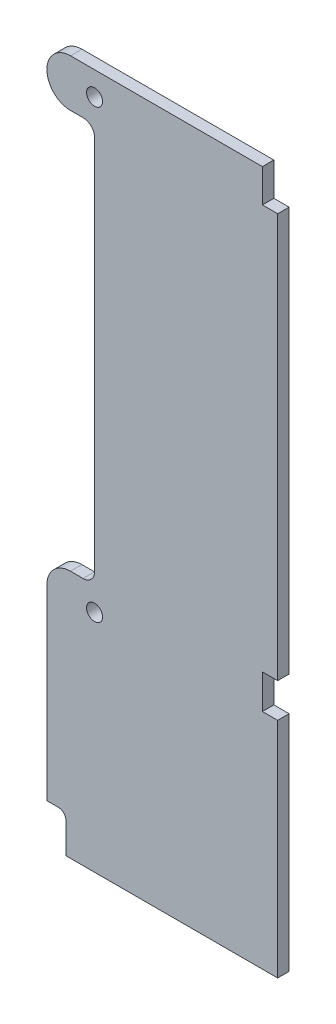
ISO-10303-21;
HEADER;
FILE_DESCRIPTION(('STEP AP214'),'2;1');
FILE_NAME('part.step','',(''),(''),'','','');
FILE_SCHEMA(('AUTOMOTIVE_DESIGN { 1 0 10303 214 1 1 1 1 }'));
ENDSEC;
DATA;
#1=APPLICATION_CONTEXT('core data for automotive mechanical design processes');
#2=APPLICATION_PROTOCOL_DEFINITION('international standard','automotive_design',2000,#1);
#3=PRODUCT_CONTEXT('',#1,'mechanical');
#4=PRODUCT('Part','Part','',(#3));
#5=PRODUCT_RELATED_PRODUCT_CATEGORY('part','',(#4));
#6=PRODUCT_DEFINITION_FORMATION('','',#4);
#7=PRODUCT_DEFINITION_CONTEXT('part definition',#1,'design');
#8=PRODUCT_DEFINITION('design','',#6,#7);
#9=PRODUCT_DEFINITION_SHAPE('','',#8);
#10=(LENGTH_UNIT() NAMED_UNIT(*) SI_UNIT(.MILLI.,.METRE.));
#11=(NAMED_UNIT(*) PLANE_ANGLE_UNIT() SI_UNIT($,.RADIAN.));
#12=(NAMED_UNIT(*) SI_UNIT($,.STERADIAN.) SOLID_ANGLE_UNIT());
#13=UNCERTAINTY_MEASURE_WITH_UNIT(LENGTH_MEASURE(1.E-05),#10,'distance_accuracy_value','');
#14=(GEOMETRIC_REPRESENTATION_CONTEXT(3) GLOBAL_UNCERTAINTY_ASSIGNED_CONTEXT((#13)) GLOBAL_UNIT_ASSIGNED_CONTEXT((#10,
#11,#12)) REPRESENTATION_CONTEXT('',''));
#15=CARTESIAN_POINT('',(0.,0.,0.));
#16=DIRECTION('',(0.,0.,1.));
#17=DIRECTION('',(1.,0.,0.));
#18=AXIS2_PLACEMENT_3D('',#15,#16,#17);
#19=CARTESIAN_POINT('',(-6.3,0.,3.));
#20=DIRECTION('',(0.,0.,1.));
#21=DIRECTION('',(1.,0.,0.));
#22=AXIS2_PLACEMENT_3D('',#19,#20,#21);
#23=PLANE('',#22);
#24=CARTESIAN_POINT('',(0.,0.,3.));
#25=DIRECTION('',(0.,0.,1.));
#26=DIRECTION('',(1.,0.,0.));
#27=AXIS2_PLACEMENT_3D('',#24,#25,#26);
#28=CIRCLE('',#27,2.1);
#29=CARTESIAN_POINT('',(2.1,0.,3.));
#30=VERTEX_POINT('',#29);
#31=EDGE_CURVE('E212',#30,#30,#28,.T.);
#32=ORIENTED_EDGE('',*,*,#31,.F.);
#33=EDGE_LOOP('',(#32));
#34=FACE_BOUND('',#33,.T.);
#35=CARTESIAN_POINT('',(-6.3,0.,3.));
#36=DIRECTION('',(0.,0.,1.));
#37=DIRECTION('',(1.,0.,0.));
#38=AXIS2_PLACEMENT_3D('',#35,#36,#37);
#39=CIRCLE('',#38,6.2);
#40=CARTESIAN_POINT('',(-6.3,6.2,3.));
#41=VERTEX_POINT('',#40);
#42=CARTESIAN_POINT('',(-12.5,0.,3.));
#43=VERTEX_POINT('',#42);
#44=EDGE_CURVE('E248',#41,#43,#39,.T.);
#45=ORIENTED_EDGE('',*,*,#44,.T.);
#46=DIRECTION('',(0.,-1.,0.));
#47=VECTOR('',#46,1.);
#48=CARTESIAN_POINT('',(-12.5,0.,3.));
#49=LINE('',#48,#47);
#50=CARTESIAN_POINT('',(-12.5,-49.,3.));
#51=VERTEX_POINT('',#50);
#52=EDGE_CURVE('E135',#43,#51,#49,.T.);
#53=ORIENTED_EDGE('',*,*,#52,.T.);
#54=DIRECTION('',(1.,0.,0.));
#55=VECTOR('',#54,1.);
#56=CARTESIAN_POINT('',(-12.5,-49.,3.));
#57=LINE('',#56,#55);
#58=CARTESIAN_POINT('',(-9.50000000000001,-49.,3.));
#59=VERTEX_POINT('',#58);
#60=EDGE_CURVE('E299',#51,#59,#57,.T.);
#61=ORIENTED_EDGE('',*,*,#60,.T.);
#62=CARTESIAN_POINT('',(-9.49999999999999,-51.,3.));
#63=DIRECTION('',(0.,0.,-1.));
#64=DIRECTION('',(1.,0.,0.));
#65=AXIS2_PLACEMENT_3D('',#62,#63,#64);
#66=CIRCLE('',#65,2.);
#67=CARTESIAN_POINT('',(-7.49999999999999,-51.,3.));
#68=VERTEX_POINT('',#67);
#69=EDGE_CURVE('E318',#59,#68,#66,.T.);
#70=ORIENTED_EDGE('',*,*,#69,.T.);
#71=DIRECTION('',(0.,-1.,0.));
#72=VECTOR('',#71,1.);
#73=CARTESIAN_POINT('',(-7.49999999999999,-51.,3.));
#74=LINE('',#73,#72);
#75=CARTESIAN_POINT('',(-7.49999999999999,-59.,3.));
#76=VERTEX_POINT('',#75);
#77=EDGE_CURVE('E315',#68,#76,#74,.T.);
#78=ORIENTED_EDGE('',*,*,#77,.T.);
#79=DIRECTION('',(1.,0.,0.));
#80=VECTOR('',#79,1.);
#81=CARTESIAN_POINT('',(-7.49999999999999,-59.,3.));
#82=LINE('',#81,#80);
#83=CARTESIAN_POINT('',(48.,-59.,3.));
#84=VERTEX_POINT('',#83);
#85=EDGE_CURVE('E317',#76,#84,#82,.T.);
#86=ORIENTED_EDGE('',*,*,#85,.T.);
#87=DIRECTION('',(0.,1.,0.));
#88=VECTOR('',#87,1.);
#89=CARTESIAN_POINT('',(48.,-0.5,3.));
#90=LINE('',#89,#88);
#91=CARTESIAN_POINT('',(48.,-0.5,3.));
#92=VERTEX_POINT('',#91);
#93=EDGE_CURVE('E320',#84,#92,#90,.T.);
#94=ORIENTED_EDGE('',*,*,#93,.T.);
#95=DIRECTION('',(-1.,0.,0.));
#96=VECTOR('',#95,1.);
#97=CARTESIAN_POINT('',(48.,-0.5,3.));
#98=LINE('',#97,#96);
#99=CARTESIAN_POINT('',(44.,-0.5,3.));
#100=VERTEX_POINT('',#99);
#101=EDGE_CURVE('E326',#92,#100,#98,.T.);
#102=ORIENTED_EDGE('',*,*,#101,.T.);
#103=DIRECTION('',(0.,1.,0.));
#104=VECTOR('',#103,1.);
#105=CARTESIAN_POINT('',(44.,-0.5,3.));
#106=LINE('',#105,#104);
#107=CARTESIAN_POINT('',(44.,8.5,3.));
#108=VERTEX_POINT('',#107);
#109=EDGE_CURVE('E328',#100,#108,#106,.T.);
#110=ORIENTED_EDGE('',*,*,#109,.T.);
#111=DIRECTION('',(1.,0.,0.));
#112=VECTOR('',#111,1.);
#113=CARTESIAN_POINT('',(44.,8.5,3.));
#114=LINE('',#113,#112);
#115=CARTESIAN_POINT('',(48.,8.5,3.));
#116=VERTEX_POINT('',#115);
#117=EDGE_CURVE('E330',#108,#116,#114,.T.);
#118=ORIENTED_EDGE('',*,*,#117,.T.);
#119=DIRECTION('',(0.,1.,0.));
#120=VECTOR('',#119,1.);
#121=CARTESIAN_POINT('',(48.,114.5,3.));
#122=LINE('',#121,#120);
#123=CARTESIAN_POINT('',(48.,114.5,3.));
#124=VERTEX_POINT('',#123);
#125=EDGE_CURVE('E332',#116,#124,#122,.T.);
#126=ORIENTED_EDGE('',*,*,#125,.T.);
#127=DIRECTION('',(-1.,0.,0.));
#128=VECTOR('',#127,1.);
#129=CARTESIAN_POINT('',(48.,114.5,3.));
#130=LINE('',#129,#128);
#131=CARTESIAN_POINT('',(44.,114.5,3.));
#132=VERTEX_POINT('',#131);
#133=EDGE_CURVE('E334',#124,#132,#130,.T.);
#134=ORIENTED_EDGE('',*,*,#133,.T.);
#135=DIRECTION('',(0.,1.,0.));
#136=VECTOR('',#135,1.);
#137=CARTESIAN_POINT('',(44.,114.5,3.));
#138=LINE('',#137,#136);
#139=CARTESIAN_POINT('',(44.,123.2,3.));
#140=VERTEX_POINT('',#139);
#141=EDGE_CURVE('E336',#132,#140,#138,.T.);
#142=ORIENTED_EDGE('',*,*,#141,.T.);
#143=DIRECTION('',(-1.,0.,0.));
#144=VECTOR('',#143,1.);
#145=CARTESIAN_POINT('',(-6.30000000000002,123.2,3.));
#146=LINE('',#145,#144);
#147=CARTESIAN_POINT('',(-6.30000000000002,123.2,3.));
#148=VERTEX_POINT('',#147);
#149=EDGE_CURVE('E338',#140,#148,#146,.T.);
#150=ORIENTED_EDGE('',*,*,#149,.T.);
#151=CARTESIAN_POINT('',(-6.30000000000002,117.,3.));
#152=DIRECTION('',(0.,0.,1.));
#153=DIRECTION('',(1.,0.,0.));
#154=AXIS2_PLACEMENT_3D('',#151,#152,#153);
#155=CIRCLE('',#154,6.2);
#156=CARTESIAN_POINT('',(-6.30000000000002,110.8,3.));
#157=VERTEX_POINT('',#156);
#158=EDGE_CURVE('E340',#148,#157,#155,.T.);
#159=ORIENTED_EDGE('',*,*,#158,.T.);
#160=DIRECTION('',(1.,0.,0.));
#161=VECTOR('',#160,1.);
#162=CARTESIAN_POINT('',(-6.30000000000002,110.8,3.));
#163=LINE('',#162,#161);
#164=CARTESIAN_POINT('',(-3.00000000000004,110.8,3.));
#165=VERTEX_POINT('',#164);
#166=EDGE_CURVE('E342',#157,#165,#163,.T.);
#167=ORIENTED_EDGE('',*,*,#166,.T.);
#168=CARTESIAN_POINT('',(-3.00000000000001,107.8,3.));
#169=DIRECTION('',(0.,0.,-1.));
#170=DIRECTION('',(1.,0.,0.));
#171=AXIS2_PLACEMENT_3D('',#168,#169,#170);
#172=CIRCLE('',#171,3.);
#173=CARTESIAN_POINT('',(0.,107.8,3.));
#174=VERTEX_POINT('',#173);
#175=EDGE_CURVE('E190',#165,#174,#172,.T.);
#176=ORIENTED_EDGE('',*,*,#175,.T.);
#177=DIRECTION('',(0.,-1.,0.));
#178=VECTOR('',#177,1.);
#179=CARTESIAN_POINT('',(0.,107.8,3.));
#180=LINE('',#179,#178);
#181=CARTESIAN_POINT('',(0.,9.20000000000002,3.));
#182=VERTEX_POINT('',#181);
#183=EDGE_CURVE('E184',#174,#182,#180,.T.);
#184=ORIENTED_EDGE('',*,*,#183,.T.);
#185=CARTESIAN_POINT('',(-3.,9.2,3.));
#186=DIRECTION('',(0.,0.,-1.));
#187=DIRECTION('',(-1.,0.,0.));
#188=AXIS2_PLACEMENT_3D('',#185,#186,#187);
#189=CIRCLE('',#188,3.);
#190=CARTESIAN_POINT('',(-3.00000000000002,6.2,3.));
#191=VERTEX_POINT('',#190);
#192=EDGE_CURVE('E188',#182,#191,#189,.T.);
#193=ORIENTED_EDGE('',*,*,#192,.T.);
#194=DIRECTION('',(-1.,0.,0.));
#195=VECTOR('',#194,1.);
#196=CARTESIAN_POINT('',(-3.00000000000002,6.2,3.));
#197=LINE('',#196,#195);
#198=EDGE_CURVE('E56',#191,#41,#197,.T.);
#199=ORIENTED_EDGE('',*,*,#198,.T.);
#200=EDGE_LOOP('',(#45,#53,#61,#70,#78,#86,#94,#102,#110,#118,#126,#134,#142,#150,#159,#167,
#176,#184,#193,#199));
#201=FACE_BOUND('',#200,.T.);
#202=CARTESIAN_POINT('',(0.,117.,3.));
#203=DIRECTION('',(0.,0.,1.));
#204=DIRECTION('',(1.,0.,0.));
#205=AXIS2_PLACEMENT_3D('',#202,#203,#204);
#206=CIRCLE('',#205,2.1);
#207=CARTESIAN_POINT('',(2.1,117.,3.));
#208=VERTEX_POINT('',#207);
#209=EDGE_CURVE('E385',#208,#208,#206,.T.);
#210=ORIENTED_EDGE('',*,*,#209,.F.);
#211=EDGE_LOOP('',(#210));
#212=FACE_BOUND('',#211,.T.);
#213=ADVANCED_FACE('F39',(#34,#201,#212),#23,.T.);
#214=CARTESIAN_POINT('',(-6.3,0.,0.));
#215=DIRECTION('',(0.,0.,1.));
#216=DIRECTION('',(1.,0.,0.));
#217=AXIS2_PLACEMENT_3D('',#214,#215,#216);
#218=PLANE('',#217);
#219=CARTESIAN_POINT('',(0.,0.,0.));
#220=DIRECTION('',(0.,0.,1.));
#221=DIRECTION('',(1.,0.,0.));
#222=AXIS2_PLACEMENT_3D('',#219,#220,#221);
#223=CIRCLE('',#222,2.1);
#224=CARTESIAN_POINT('',(2.1,0.,0.));
#225=VERTEX_POINT('',#224);
#226=EDGE_CURVE('E390',#225,#225,#223,.T.);
#227=ORIENTED_EDGE('',*,*,#226,.T.);
#228=EDGE_LOOP('',(#227));
#229=FACE_BOUND('',#228,.T.);
#230=CARTESIAN_POINT('',(-6.3,0.,0.));
#231=DIRECTION('',(0.,0.,1.));
#232=DIRECTION('',(1.,0.,0.));
#233=AXIS2_PLACEMENT_3D('',#230,#231,#232);
#234=CIRCLE('',#233,6.2);
#235=CARTESIAN_POINT('',(-6.3,6.2,0.));
#236=VERTEX_POINT('',#235);
#237=CARTESIAN_POINT('',(-12.5,0.,0.));
#238=VERTEX_POINT('',#237);
#239=EDGE_CURVE('E208',#236,#238,#234,.T.);
#240=ORIENTED_EDGE('',*,*,#239,.F.);
#241=DIRECTION('',(-1.,0.,0.));
#242=VECTOR('',#241,1.);
#243=CARTESIAN_POINT('',(-3.00000000000002,6.2,0.));
#244=LINE('',#243,#242);
#245=CARTESIAN_POINT('',(-3.00000000000002,6.2,0.));
#246=VERTEX_POINT('',#245);
#247=EDGE_CURVE('E127',#246,#236,#244,.T.);
#248=ORIENTED_EDGE('',*,*,#247,.F.);
#249=CARTESIAN_POINT('',(-3.,9.2,0.));
#250=DIRECTION('',(0.,0.,-1.));
#251=DIRECTION('',(-1.,0.,0.));
#252=AXIS2_PLACEMENT_3D('',#249,#250,#251);
#253=CIRCLE('',#252,3.);
#254=CARTESIAN_POINT('',(0.,9.20000000000002,0.));
#255=VERTEX_POINT('',#254);
#256=EDGE_CURVE('E121',#255,#246,#253,.T.);
#257=ORIENTED_EDGE('',*,*,#256,.F.);
#258=DIRECTION('',(0.,-1.,0.));
#259=VECTOR('',#258,1.);
#260=CARTESIAN_POINT('',(0.,107.8,0.));
#261=LINE('',#260,#259);
#262=CARTESIAN_POINT('',(0.,107.8,0.));
#263=VERTEX_POINT('',#262);
#264=EDGE_CURVE('E198',#263,#255,#261,.T.);
#265=ORIENTED_EDGE('',*,*,#264,.F.);
#266=CARTESIAN_POINT('',(-3.00000000000001,107.8,0.));
#267=DIRECTION('',(0.,0.,-1.));
#268=DIRECTION('',(1.,0.,0.));
#269=AXIS2_PLACEMENT_3D('',#266,#267,#268);
#270=CIRCLE('',#269,3.);
#271=CARTESIAN_POINT('',(-3.00000000000004,110.8,0.));
#272=VERTEX_POINT('',#271);
#273=EDGE_CURVE('E243',#272,#263,#270,.T.);
#274=ORIENTED_EDGE('',*,*,#273,.F.);
#275=DIRECTION('',(1.,0.,0.));
#276=VECTOR('',#275,1.);
#277=CARTESIAN_POINT('',(-6.30000000000002,110.8,0.));
#278=LINE('',#277,#276);
#279=CARTESIAN_POINT('',(-6.30000000000002,110.8,0.));
#280=VERTEX_POINT('',#279);
#281=EDGE_CURVE('E241',#280,#272,#278,.T.);
#282=ORIENTED_EDGE('',*,*,#281,.F.);
#283=CARTESIAN_POINT('',(-6.30000000000002,117.,0.));
#284=DIRECTION('',(0.,0.,1.));
#285=DIRECTION('',(1.,0.,0.));
#286=AXIS2_PLACEMENT_3D('',#283,#284,#285);
#287=CIRCLE('',#286,6.2);
#288=CARTESIAN_POINT('',(-6.30000000000002,123.2,0.));
#289=VERTEX_POINT('',#288);
#290=EDGE_CURVE('E239',#289,#280,#287,.T.);
#291=ORIENTED_EDGE('',*,*,#290,.F.);
#292=DIRECTION('',(-1.,0.,0.));
#293=VECTOR('',#292,1.);
#294=CARTESIAN_POINT('',(-6.30000000000002,123.2,0.));
#295=LINE('',#294,#293);
#296=CARTESIAN_POINT('',(44.,123.2,0.));
#297=VERTEX_POINT('',#296);
#298=EDGE_CURVE('E237',#297,#289,#295,.T.);
#299=ORIENTED_EDGE('',*,*,#298,.F.);
#300=DIRECTION('',(0.,1.,0.));
#301=VECTOR('',#300,1.);
#302=CARTESIAN_POINT('',(44.,114.5,0.));
#303=LINE('',#302,#301);
#304=CARTESIAN_POINT('',(44.,114.5,0.));
#305=VERTEX_POINT('',#304);
#306=EDGE_CURVE('E235',#305,#297,#303,.T.);
#307=ORIENTED_EDGE('',*,*,#306,.F.);
#308=DIRECTION('',(-1.,0.,0.));
#309=VECTOR('',#308,1.);
#310=CARTESIAN_POINT('',(48.,114.5,0.));
#311=LINE('',#310,#309);
#312=CARTESIAN_POINT('',(48.,114.5,0.));
#313=VERTEX_POINT('',#312);
#314=EDGE_CURVE('E233',#313,#305,#311,.T.);
#315=ORIENTED_EDGE('',*,*,#314,.F.);
#316=DIRECTION('',(0.,1.,0.));
#317=VECTOR('',#316,1.);
#318=CARTESIAN_POINT('',(48.,114.5,0.));
#319=LINE('',#318,#317);
#320=CARTESIAN_POINT('',(48.,8.5,0.));
#321=VERTEX_POINT('',#320);
#322=EDGE_CURVE('E231',#321,#313,#319,.T.);
#323=ORIENTED_EDGE('',*,*,#322,.F.);
#324=DIRECTION('',(1.,0.,0.));
#325=VECTOR('',#324,1.);
#326=CARTESIAN_POINT('',(44.,8.5,0.));
#327=LINE('',#326,#325);
#328=CARTESIAN_POINT('',(44.,8.5,0.));
#329=VERTEX_POINT('',#328);
#330=EDGE_CURVE('E229',#329,#321,#327,.T.);
#331=ORIENTED_EDGE('',*,*,#330,.F.);
#332=DIRECTION('',(0.,1.,0.));
#333=VECTOR('',#332,1.);
#334=CARTESIAN_POINT('',(44.,-0.5,0.));
#335=LINE('',#334,#333);
#336=CARTESIAN_POINT('',(44.,-0.5,0.));
#337=VERTEX_POINT('',#336);
#338=EDGE_CURVE('E227',#337,#329,#335,.T.);
#339=ORIENTED_EDGE('',*,*,#338,.F.);
#340=DIRECTION('',(-1.,0.,0.));
#341=VECTOR('',#340,1.);
#342=CARTESIAN_POINT('',(48.,-0.5,0.));
#343=LINE('',#342,#341);
#344=CARTESIAN_POINT('',(48.,-0.5,0.));
#345=VERTEX_POINT('',#344);
#346=EDGE_CURVE('E225',#345,#337,#343,.T.);
#347=ORIENTED_EDGE('',*,*,#346,.F.);
#348=DIRECTION('',(0.,1.,0.));
#349=VECTOR('',#348,1.);
#350=CARTESIAN_POINT('',(48.,-0.5,0.));
#351=LINE('',#350,#349);
#352=CARTESIAN_POINT('',(48.,-59.,0.));
#353=VERTEX_POINT('',#352);
#354=EDGE_CURVE('E223',#353,#345,#351,.T.);
#355=ORIENTED_EDGE('',*,*,#354,.F.);
#356=DIRECTION('',(1.,0.,0.));
#357=VECTOR('',#356,1.);
#358=CARTESIAN_POINT('',(-7.49999999999999,-59.,0.));
#359=LINE('',#358,#357);
#360=CARTESIAN_POINT('',(-7.49999999999999,-59.,0.));
#361=VERTEX_POINT('',#360);
#362=EDGE_CURVE('E221',#361,#353,#359,.T.);
#363=ORIENTED_EDGE('',*,*,#362,.F.);
#364=DIRECTION('',(0.,-1.,0.));
#365=VECTOR('',#364,1.);
#366=CARTESIAN_POINT('',(-7.49999999999999,-51.,0.));
#367=LINE('',#366,#365);
#368=CARTESIAN_POINT('',(-7.49999999999999,-51.,0.));
#369=VERTEX_POINT('',#368);
#370=EDGE_CURVE('E219',#369,#361,#367,.T.);
#371=ORIENTED_EDGE('',*,*,#370,.F.);
#372=CARTESIAN_POINT('',(-9.49999999999999,-51.,0.));
#373=DIRECTION('',(0.,0.,-1.));
#374=DIRECTION('',(1.,0.,0.));
#375=AXIS2_PLACEMENT_3D('',#372,#373,#374);
#376=CIRCLE('',#375,2.);
#377=CARTESIAN_POINT('',(-9.50000000000001,-49.,0.));
#378=VERTEX_POINT('',#377);
#379=EDGE_CURVE('E217',#378,#369,#376,.T.);
#380=ORIENTED_EDGE('',*,*,#379,.F.);
#381=DIRECTION('',(1.,0.,0.));
#382=VECTOR('',#381,1.);
#383=CARTESIAN_POINT('',(-12.5,-49.,0.));
#384=LINE('',#383,#382);
#385=CARTESIAN_POINT('',(-12.5,-49.,0.));
#386=VERTEX_POINT('',#385);
#387=EDGE_CURVE('E215',#386,#378,#384,.T.);
#388=ORIENTED_EDGE('',*,*,#387,.F.);
#389=DIRECTION('',(0.,-1.,0.));
#390=VECTOR('',#389,1.);
#391=CARTESIAN_POINT('',(-12.5,0.,0.));
#392=LINE('',#391,#390);
#393=EDGE_CURVE('E211',#238,#386,#392,.T.);
#394=ORIENTED_EDGE('',*,*,#393,.F.);
#395=EDGE_LOOP('',(#240,#248,#257,#265,#274,#282,#291,#299,#307,#315,#323,#331,#339,#347,#355,
#363,#371,#380,#388,#394));
#396=FACE_BOUND('',#395,.T.);
#397=CARTESIAN_POINT('',(0.,117.,0.));
#398=DIRECTION('',(0.,0.,1.));
#399=DIRECTION('',(1.,0.,0.));
#400=AXIS2_PLACEMENT_3D('',#397,#398,#399);
#401=CIRCLE('',#400,2.1);
#402=CARTESIAN_POINT('',(2.1,117.,0.));
#403=VERTEX_POINT('',#402);
#404=EDGE_CURVE('E388',#403,#403,#401,.T.);
#405=ORIENTED_EDGE('',*,*,#404,.T.);
#406=EDGE_LOOP('',(#405));
#407=FACE_BOUND('',#406,.T.);
#408=ADVANCED_FACE('F303',(#229,#396,#407),#218,.F.);
#409=CARTESIAN_POINT('',(-6.3,0.,3.));
#410=DIRECTION('',(0.,0.,-1.));
#411=DIRECTION('',(-1.,0.,0.));
#412=AXIS2_PLACEMENT_3D('',#409,#410,#411);
#413=CYLINDRICAL_SURFACE('',#412,6.2);
#414=ORIENTED_EDGE('',*,*,#239,.T.);
#415=DIRECTION('',(0.,0.,-1.));
#416=VECTOR('',#415,1.);
#417=CARTESIAN_POINT('',(-12.5,0.,3.));
#418=LINE('',#417,#416);
#419=EDGE_CURVE('E11',#43,#238,#418,.T.);
#420=ORIENTED_EDGE('',*,*,#419,.F.);
#421=ORIENTED_EDGE('',*,*,#44,.F.);
#422=DIRECTION('',(0.,0.,-1.));
#423=VECTOR('',#422,1.);
#424=CARTESIAN_POINT('',(-6.3,6.2,3.));
#425=LINE('',#424,#423);
#426=EDGE_CURVE('E204',#41,#236,#425,.T.);
#427=ORIENTED_EDGE('',*,*,#426,.T.);
#428=EDGE_LOOP('',(#414,#420,#421,#427));
#429=FACE_BOUND('',#428,.T.);
#430=ADVANCED_FACE('F41',(#429),#413,.T.);
#431=CARTESIAN_POINT('',(-12.5,0.,3.));
#432=DIRECTION('',(1.,0.,0.));
#433=DIRECTION('',(0.,1.,0.));
#434=AXIS2_PLACEMENT_3D('',#431,#432,#433);
#435=PLANE('',#434);
#436=ORIENTED_EDGE('',*,*,#393,.T.);
#437=DIRECTION('',(0.,0.,-1.));
#438=VECTOR('',#437,1.);
#439=CARTESIAN_POINT('',(-12.5,-49.,3.));
#440=LINE('',#439,#438);
#441=EDGE_CURVE('E48',#51,#386,#440,.T.);
#442=ORIENTED_EDGE('',*,*,#441,.F.);
#443=ORIENTED_EDGE('',*,*,#52,.F.);
#444=ORIENTED_EDGE('',*,*,#419,.T.);
#445=EDGE_LOOP('',(#436,#442,#443,#444));
#446=FACE_BOUND('',#445,.T.);
#447=ADVANCED_FACE('F564',(#446),#435,.F.);
#448=CARTESIAN_POINT('',(-12.5,-49.,3.));
#449=DIRECTION('',(0.,1.,0.));
#450=DIRECTION('',(0.,0.,1.));
#451=AXIS2_PLACEMENT_3D('',#448,#449,#450);
#452=PLANE('',#451);
#453=ORIENTED_EDGE('',*,*,#387,.T.);
#454=DIRECTION('',(0.,0.,-1.));
#455=VECTOR('',#454,1.);
#456=CARTESIAN_POINT('',(-9.50000000000001,-49.,3.));
#457=LINE('',#456,#455);
#458=EDGE_CURVE('E291',#59,#378,#457,.T.);
#459=ORIENTED_EDGE('',*,*,#458,.F.);
#460=ORIENTED_EDGE('',*,*,#60,.F.);
#461=ORIENTED_EDGE('',*,*,#441,.T.);
#462=EDGE_LOOP('',(#453,#459,#460,#461));
#463=FACE_BOUND('',#462,.T.);
#464=ADVANCED_FACE('F297',(#463),#452,.F.);
#465=CARTESIAN_POINT('',(-9.49999999999999,-51.,3.));
#466=DIRECTION('',(0.,0.,-1.));
#467=DIRECTION('',(-1.,0.,0.));
#468=AXIS2_PLACEMENT_3D('',#465,#466,#467);
#469=CYLINDRICAL_SURFACE('',#468,2.);
#470=ORIENTED_EDGE('',*,*,#379,.T.);
#471=DIRECTION('',(0.,0.,-1.));
#472=VECTOR('',#471,1.);
#473=CARTESIAN_POINT('',(-7.49999999999999,-51.,3.));
#474=LINE('',#473,#472);
#475=EDGE_CURVE('E288',#68,#369,#474,.T.);
#476=ORIENTED_EDGE('',*,*,#475,.F.);
#477=ORIENTED_EDGE('',*,*,#69,.F.);
#478=ORIENTED_EDGE('',*,*,#458,.T.);
#479=EDGE_LOOP('',(#470,#476,#477,#478));
#480=FACE_BOUND('',#479,.T.);
#481=ADVANCED_FACE('F309',(#480),#469,.F.);
#482=CARTESIAN_POINT('',(-7.49999999999999,-51.,3.));
#483=DIRECTION('',(1.,0.,0.));
#484=DIRECTION('',(0.,1.,0.));
#485=AXIS2_PLACEMENT_3D('',#482,#483,#484);
#486=PLANE('',#485);
#487=ORIENTED_EDGE('',*,*,#370,.T.);
#488=DIRECTION('',(0.,0.,-1.));
#489=VECTOR('',#488,1.);
#490=CARTESIAN_POINT('',(-7.49999999999999,-59.,3.));
#491=LINE('',#490,#489);
#492=EDGE_CURVE('E285',#76,#361,#491,.T.);
#493=ORIENTED_EDGE('',*,*,#492,.F.);
#494=ORIENTED_EDGE('',*,*,#77,.F.);
#495=ORIENTED_EDGE('',*,*,#475,.T.);
#496=EDGE_LOOP('',(#487,#493,#494,#495));
#497=FACE_BOUND('',#496,.T.);
#498=ADVANCED_FACE('F313',(#497),#486,.F.);
#499=CARTESIAN_POINT('',(-7.49999999999999,-59.,3.));
#500=DIRECTION('',(0.,1.,0.));
#501=DIRECTION('',(0.,0.,1.));
#502=AXIS2_PLACEMENT_3D('',#499,#500,#501);
#503=PLANE('',#502);
#504=ORIENTED_EDGE('',*,*,#362,.T.);
#505=DIRECTION('',(0.,0.,-1.));
#506=VECTOR('',#505,1.);
#507=CARTESIAN_POINT('',(48.,-59.,3.));
#508=LINE('',#507,#506);
#509=EDGE_CURVE('E282',#84,#353,#508,.T.);
#510=ORIENTED_EDGE('',*,*,#509,.F.);
#511=ORIENTED_EDGE('',*,*,#85,.F.);
#512=ORIENTED_EDGE('',*,*,#492,.T.);
#513=EDGE_LOOP('',(#504,#510,#511,#512));
#514=FACE_BOUND('',#513,.T.);
#515=ADVANCED_FACE('F529',(#514),#503,.F.);
#516=CARTESIAN_POINT('',(48.,-0.5,3.));
#517=DIRECTION('',(-1.,0.,0.));
#518=DIRECTION('',(0.,-1.,0.));
#519=AXIS2_PLACEMENT_3D('',#516,#517,#518);
#520=PLANE('',#519);
#521=ORIENTED_EDGE('',*,*,#354,.T.);
#522=DIRECTION('',(0.,0.,-1.));
#523=VECTOR('',#522,1.);
#524=CARTESIAN_POINT('',(48.,-0.5,3.));
#525=LINE('',#524,#523);
#526=EDGE_CURVE('E279',#92,#345,#525,.T.);
#527=ORIENTED_EDGE('',*,*,#526,.F.);
#528=ORIENTED_EDGE('',*,*,#93,.F.);
#529=ORIENTED_EDGE('',*,*,#509,.T.);
#530=EDGE_LOOP('',(#521,#527,#528,#529));
#531=FACE_BOUND('',#530,.T.);
#532=ADVANCED_FACE('F519',(#531),#520,.F.);
#533=CARTESIAN_POINT('',(48.,-0.5,3.));
#534=DIRECTION('',(0.,-1.,0.));
#535=DIRECTION('',(0.,0.,-1.));
#536=AXIS2_PLACEMENT_3D('',#533,#534,#535);
#537=PLANE('',#536);
#538=ORIENTED_EDGE('',*,*,#346,.T.);
#539=DIRECTION('',(0.,0.,-1.));
#540=VECTOR('',#539,1.);
#541=CARTESIAN_POINT('',(44.,-0.5,3.));
#542=LINE('',#541,#540);
#543=EDGE_CURVE('E276',#100,#337,#542,.T.);
#544=ORIENTED_EDGE('',*,*,#543,.F.);
#545=ORIENTED_EDGE('',*,*,#101,.F.);
#546=ORIENTED_EDGE('',*,*,#526,.T.);
#547=EDGE_LOOP('',(#538,#544,#545,#546));
#548=FACE_BOUND('',#547,.T.);
#549=ADVANCED_FACE('F509',(#548),#537,.F.);
#550=CARTESIAN_POINT('',(44.,-0.5,3.));
#551=DIRECTION('',(-1.,0.,0.));
#552=DIRECTION('',(0.,-1.,0.));
#553=AXIS2_PLACEMENT_3D('',#550,#551,#552);
#554=PLANE('',#553);
#555=ORIENTED_EDGE('',*,*,#338,.T.);
#556=DIRECTION('',(0.,0.,-1.));
#557=VECTOR('',#556,1.);
#558=CARTESIAN_POINT('',(44.,8.5,3.));
#559=LINE('',#558,#557);
#560=EDGE_CURVE('E273',#108,#329,#559,.T.);
#561=ORIENTED_EDGE('',*,*,#560,.F.);
#562=ORIENTED_EDGE('',*,*,#109,.F.);
#563=ORIENTED_EDGE('',*,*,#543,.T.);
#564=EDGE_LOOP('',(#555,#561,#562,#563));
#565=FACE_BOUND('',#564,.T.);
#566=ADVANCED_FACE('F499',(#565),#554,.F.);
#567=CARTESIAN_POINT('',(44.,8.5,3.));
#568=DIRECTION('',(0.,1.,0.));
#569=DIRECTION('',(0.,0.,1.));
#570=AXIS2_PLACEMENT_3D('',#567,#568,#569);
#571=PLANE('',#570);
#572=ORIENTED_EDGE('',*,*,#330,.T.);
#573=DIRECTION('',(0.,0.,-1.));
#574=VECTOR('',#573,1.);
#575=CARTESIAN_POINT('',(48.,8.5,3.));
#576=LINE('',#575,#574);
#577=EDGE_CURVE('E270',#116,#321,#576,.T.);
#578=ORIENTED_EDGE('',*,*,#577,.F.);
#579=ORIENTED_EDGE('',*,*,#117,.F.);
#580=ORIENTED_EDGE('',*,*,#560,.T.);
#581=EDGE_LOOP('',(#572,#578,#579,#580));
#582=FACE_BOUND('',#581,.T.);
#583=ADVANCED_FACE('F489',(#582),#571,.F.);
#584=CARTESIAN_POINT('',(48.,114.5,3.));
#585=DIRECTION('',(-1.,0.,0.));
#586=DIRECTION('',(0.,-1.,0.));
#587=AXIS2_PLACEMENT_3D('',#584,#585,#586);
#588=PLANE('',#587);
#589=ORIENTED_EDGE('',*,*,#322,.T.);
#590=DIRECTION('',(0.,0.,-1.));
#591=VECTOR('',#590,1.);
#592=CARTESIAN_POINT('',(48.,114.5,3.));
#593=LINE('',#592,#591);
#594=EDGE_CURVE('E267',#124,#313,#593,.T.);
#595=ORIENTED_EDGE('',*,*,#594,.F.);
#596=ORIENTED_EDGE('',*,*,#125,.F.);
#597=ORIENTED_EDGE('',*,*,#577,.T.);
#598=EDGE_LOOP('',(#589,#595,#596,#597));
#599=FACE_BOUND('',#598,.T.);
#600=ADVANCED_FACE('F479',(#599),#588,.F.);
#601=CARTESIAN_POINT('',(48.,114.5,3.));
#602=DIRECTION('',(0.,-1.,0.));
#603=DIRECTION('',(0.,0.,-1.));
#604=AXIS2_PLACEMENT_3D('',#601,#602,#603);
#605=PLANE('',#604);
#606=ORIENTED_EDGE('',*,*,#314,.T.);
#607=DIRECTION('',(0.,0.,-1.));
#608=VECTOR('',#607,1.);
#609=CARTESIAN_POINT('',(44.,114.5,3.));
#610=LINE('',#609,#608);
#611=EDGE_CURVE('E264',#132,#305,#610,.T.);
#612=ORIENTED_EDGE('',*,*,#611,.F.);
#613=ORIENTED_EDGE('',*,*,#133,.F.);
#614=ORIENTED_EDGE('',*,*,#594,.T.);
#615=EDGE_LOOP('',(#606,#612,#613,#614));
#616=FACE_BOUND('',#615,.T.);
#617=ADVANCED_FACE('F469',(#616),#605,.F.);
#618=CARTESIAN_POINT('',(44.,114.5,3.));
#619=DIRECTION('',(-1.,0.,0.));
#620=DIRECTION('',(0.,0.,1.));
#621=AXIS2_PLACEMENT_3D('',#618,#619,#620);
#622=PLANE('',#621);
#623=ORIENTED_EDGE('',*,*,#306,.T.);
#624=DIRECTION('',(0.,0.,-1.));
#625=VECTOR('',#624,1.);
#626=CARTESIAN_POINT('',(44.,123.2,3.));
#627=LINE('',#626,#625);
#628=EDGE_CURVE('E261',#140,#297,#627,.T.);
#629=ORIENTED_EDGE('',*,*,#628,.F.);
#630=ORIENTED_EDGE('',*,*,#141,.F.);
#631=ORIENTED_EDGE('',*,*,#611,.T.);
#632=EDGE_LOOP('',(#623,#629,#630,#631));
#633=FACE_BOUND('',#632,.T.);
#634=ADVANCED_FACE('F459',(#633),#622,.F.);
#635=CARTESIAN_POINT('',(-6.30000000000002,123.2,3.));
#636=DIRECTION('',(0.,-1.,0.));
#637=DIRECTION('',(0.,0.,-1.));
#638=AXIS2_PLACEMENT_3D('',#635,#636,#637);
#639=PLANE('',#638);
#640=ORIENTED_EDGE('',*,*,#298,.T.);
#641=DIRECTION('',(0.,0.,-1.));
#642=VECTOR('',#641,1.);
#643=CARTESIAN_POINT('',(-6.30000000000002,123.2,3.));
#644=LINE('',#643,#642);
#645=EDGE_CURVE('E258',#148,#289,#644,.T.);
#646=ORIENTED_EDGE('',*,*,#645,.F.);
#647=ORIENTED_EDGE('',*,*,#149,.F.);
#648=ORIENTED_EDGE('',*,*,#628,.T.);
#649=EDGE_LOOP('',(#640,#646,#647,#648));
#650=FACE_BOUND('',#649,.T.);
#651=ADVANCED_FACE('F449',(#650),#639,.F.);
#652=CARTESIAN_POINT('',(-6.30000000000002,117.,3.));
#653=DIRECTION('',(0.,0.,-1.));
#654=DIRECTION('',(-1.,0.,0.));
#655=AXIS2_PLACEMENT_3D('',#652,#653,#654);
#656=CYLINDRICAL_SURFACE('',#655,6.2);
#657=ORIENTED_EDGE('',*,*,#290,.T.);
#658=DIRECTION('',(0.,0.,-1.));
#659=VECTOR('',#658,1.);
#660=CARTESIAN_POINT('',(-6.30000000000002,110.8,3.));
#661=LINE('',#660,#659);
#662=EDGE_CURVE('E255',#157,#280,#661,.T.);
#663=ORIENTED_EDGE('',*,*,#662,.F.);
#664=ORIENTED_EDGE('',*,*,#158,.F.);
#665=ORIENTED_EDGE('',*,*,#645,.T.);
#666=EDGE_LOOP('',(#657,#663,#664,#665));
#667=FACE_BOUND('',#666,.T.);
#668=ADVANCED_FACE('F440',(#667),#656,.T.);
#669=CARTESIAN_POINT('',(-6.30000000000002,110.8,3.));
#670=DIRECTION('',(0.,1.,0.));
#671=DIRECTION('',(0.,0.,1.));
#672=AXIS2_PLACEMENT_3D('',#669,#670,#671);
#673=PLANE('',#672);
#674=ORIENTED_EDGE('',*,*,#281,.T.);
#675=DIRECTION('',(0.,0.,-1.));
#676=VECTOR('',#675,1.);
#677=CARTESIAN_POINT('',(-3.00000000000004,110.8,3.));
#678=LINE('',#677,#676);
#679=EDGE_CURVE('E252',#165,#272,#678,.T.);
#680=ORIENTED_EDGE('',*,*,#679,.F.);
#681=ORIENTED_EDGE('',*,*,#166,.F.);
#682=ORIENTED_EDGE('',*,*,#662,.T.);
#683=EDGE_LOOP('',(#674,#680,#681,#682));
#684=FACE_BOUND('',#683,.T.);
#685=ADVANCED_FACE('F348',(#684),#673,.F.);
#686=CARTESIAN_POINT('',(-3.00000000000001,107.8,3.));
#687=DIRECTION('',(0.,0.,-1.));
#688=DIRECTION('',(-1.,0.,0.));
#689=AXIS2_PLACEMENT_3D('',#686,#687,#688);
#690=CYLINDRICAL_SURFACE('',#689,3.);
#691=ORIENTED_EDGE('',*,*,#273,.T.);
#692=DIRECTION('',(0.,0.,-1.));
#693=VECTOR('',#692,1.);
#694=CARTESIAN_POINT('',(0.,107.8,3.));
#695=LINE('',#694,#693);
#696=EDGE_CURVE('E199',#174,#263,#695,.T.);
#697=ORIENTED_EDGE('',*,*,#696,.F.);
#698=ORIENTED_EDGE('',*,*,#175,.F.);
#699=ORIENTED_EDGE('',*,*,#679,.T.);
#700=EDGE_LOOP('',(#691,#697,#698,#699));
#701=FACE_BOUND('',#700,.T.);
#702=ADVANCED_FACE('F352',(#701),#690,.F.);
#703=CARTESIAN_POINT('',(0.,107.8,3.));
#704=DIRECTION('',(1.,0.,0.));
#705=DIRECTION('',(0.,1.,0.));
#706=AXIS2_PLACEMENT_3D('',#703,#704,#705);
#707=PLANE('',#706);
#708=ORIENTED_EDGE('',*,*,#264,.T.);
#709=DIRECTION('',(0.,0.,-1.));
#710=VECTOR('',#709,1.);
#711=CARTESIAN_POINT('',(0.,9.20000000000002,3.));
#712=LINE('',#711,#710);
#713=EDGE_CURVE('E195',#182,#255,#712,.T.);
#714=ORIENTED_EDGE('',*,*,#713,.F.);
#715=ORIENTED_EDGE('',*,*,#183,.F.);
#716=ORIENTED_EDGE('',*,*,#696,.T.);
#717=EDGE_LOOP('',(#708,#714,#715,#716));
#718=FACE_BOUND('',#717,.T.);
#719=ADVANCED_FACE('F196',(#718),#707,.F.);
#720=CARTESIAN_POINT('',(-3.,9.2,3.));
#721=DIRECTION('',(0.,0.,-1.));
#722=DIRECTION('',(-1.,0.,0.));
#723=AXIS2_PLACEMENT_3D('',#720,#721,#722);
#724=CYLINDRICAL_SURFACE('',#723,3.);
#725=ORIENTED_EDGE('',*,*,#256,.T.);
#726=DIRECTION('',(0.,0.,-1.));
#727=VECTOR('',#726,1.);
#728=CARTESIAN_POINT('',(-3.00000000000002,6.2,3.));
#729=LINE('',#728,#727);
#730=EDGE_CURVE('E200',#191,#246,#729,.T.);
#731=ORIENTED_EDGE('',*,*,#730,.F.);
#732=ORIENTED_EDGE('',*,*,#192,.F.);
#733=ORIENTED_EDGE('',*,*,#713,.T.);
#734=EDGE_LOOP('',(#725,#731,#732,#733));
#735=FACE_BOUND('',#734,.T.);
#736=ADVANCED_FACE('F202',(#735),#724,.F.);
#737=CARTESIAN_POINT('',(-3.00000000000002,6.2,3.));
#738=DIRECTION('',(0.,-1.,0.));
#739=DIRECTION('',(0.,0.,-1.));
#740=AXIS2_PLACEMENT_3D('',#737,#738,#739);
#741=PLANE('',#740);
#742=ORIENTED_EDGE('',*,*,#247,.T.);
#743=ORIENTED_EDGE('',*,*,#426,.F.);
#744=ORIENTED_EDGE('',*,*,#198,.F.);
#745=ORIENTED_EDGE('',*,*,#730,.T.);
#746=EDGE_LOOP('',(#742,#743,#744,#745));
#747=FACE_BOUND('',#746,.T.);
#748=ADVANCED_FACE('F356',(#747),#741,.F.);
#749=CARTESIAN_POINT('',(0.,0.,3.));
#750=DIRECTION('',(0.,0.,-1.));
#751=DIRECTION('',(-1.,0.,0.));
#752=AXIS2_PLACEMENT_3D('',#749,#750,#751);
#753=CYLINDRICAL_SURFACE('',#752,2.1);
#754=ORIENTED_EDGE('',*,*,#31,.T.);
#755=EDGE_LOOP('',(#754));
#756=FACE_BOUND('',#755,.T.);
#757=ORIENTED_EDGE('',*,*,#226,.F.);
#758=EDGE_LOOP('',(#757));
#759=FACE_BOUND('',#758,.T.);
#760=ADVANCED_FACE('F358',(#756,#759),#753,.F.);
#761=CARTESIAN_POINT('',(0.,117.,3.));
#762=DIRECTION('',(0.,0.,-1.));
#763=DIRECTION('',(-1.,0.,0.));
#764=AXIS2_PLACEMENT_3D('',#761,#762,#763);
#765=CYLINDRICAL_SURFACE('',#764,2.1);
#766=ORIENTED_EDGE('',*,*,#209,.T.);
#767=EDGE_LOOP('',(#766));
#768=FACE_BOUND('',#767,.T.);
#769=ORIENTED_EDGE('',*,*,#404,.F.);
#770=EDGE_LOOP('',(#769));
#771=FACE_BOUND('',#770,.T.);
#772=ADVANCED_FACE('F364',(#768,#771),#765,.F.);
#773=CLOSED_SHELL('',(#213,#408,#430,#447,#464,#481,#498,#515,#532,#549,#566,#583,#600,#617,
#634,#651,#668,#685,#702,#719,#736,#748,#760,#772));
#774=MANIFOLD_SOLID_BREP('B2',#773);
#775=ADVANCED_BREP_SHAPE_REPRESENTATION('',(#18,#774),#14);
#776=SHAPE_DEFINITION_REPRESENTATION(#9,#775);
ENDSEC;
END-ISO-10303-21;
